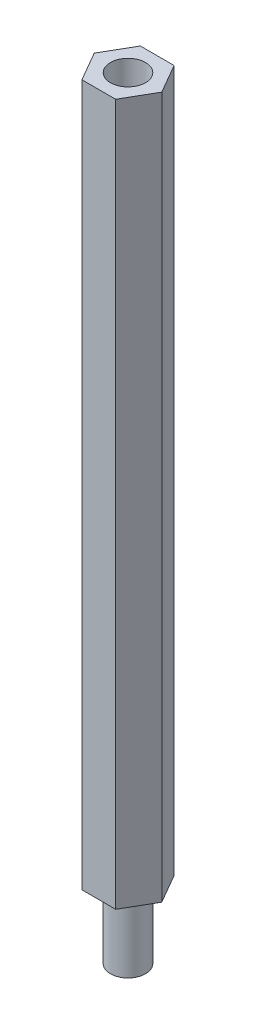
ISO-10303-21;
HEADER;
FILE_DESCRIPTION(('STEP AP214'),'2;1');
FILE_NAME('part.step','',(''),(''),'','','');
FILE_SCHEMA(('AUTOMOTIVE_DESIGN { 1 0 10303 214 1 1 1 1 }'));
ENDSEC;
DATA;
#1=APPLICATION_CONTEXT('core data for automotive mechanical design processes');
#2=APPLICATION_PROTOCOL_DEFINITION('international standard','automotive_design',2000,#1);
#3=PRODUCT_CONTEXT('',#1,'mechanical');
#4=PRODUCT('Part','Part','',(#3));
#5=PRODUCT_RELATED_PRODUCT_CATEGORY('part','',(#4));
#6=PRODUCT_DEFINITION_FORMATION('','',#4);
#7=PRODUCT_DEFINITION_CONTEXT('part definition',#1,'design');
#8=PRODUCT_DEFINITION('design','',#6,#7);
#9=PRODUCT_DEFINITION_SHAPE('','',#8);
#10=(LENGTH_UNIT() NAMED_UNIT(*) SI_UNIT(.MILLI.,.METRE.));
#11=(NAMED_UNIT(*) PLANE_ANGLE_UNIT() SI_UNIT($,.RADIAN.));
#12=(NAMED_UNIT(*) SI_UNIT($,.STERADIAN.) SOLID_ANGLE_UNIT());
#13=UNCERTAINTY_MEASURE_WITH_UNIT(LENGTH_MEASURE(1.E-05),#10,'distance_accuracy_value','');
#14=(GEOMETRIC_REPRESENTATION_CONTEXT(3) GLOBAL_UNCERTAINTY_ASSIGNED_CONTEXT((#13)) GLOBAL_UNIT_ASSIGNED_CONTEXT((#10,
#11,#12)) REPRESENTATION_CONTEXT('',''));
#15=CARTESIAN_POINT('',(0.,0.,0.));
#16=DIRECTION('',(0.,0.,1.));
#17=DIRECTION('',(1.,0.,0.));
#18=AXIS2_PLACEMENT_3D('',#15,#16,#17);
#19=CARTESIAN_POINT('',(-118.553263391177,736.792319552453,160.917570962768));
#20=DIRECTION('',(0.,1.,0.));
#21=DIRECTION('',(0.,0.,-1.));
#22=AXIS2_PLACEMENT_3D('',#19,#20,#21);
#23=CYLINDRICAL_SURFACE('',#22,1.);
#24=CARTESIAN_POINT('',(-118.553263391177,729.292319552453,160.917570962768));
#25=DIRECTION('',(0.,-1.,0.));
#26=DIRECTION('',(0.,0.,-1.));
#27=AXIS2_PLACEMENT_3D('',#24,#25,#26);
#28=CIRCLE('',#27,1.);
#29=CARTESIAN_POINT('',(-118.553263391177,729.292319552453,159.917570962768));
#30=VERTEX_POINT('',#29);
#31=EDGE_CURVE('E201',#30,#30,#28,.F.);
#32=ORIENTED_EDGE('',*,*,#31,.F.);
#33=EDGE_LOOP('',(#32));
#34=FACE_BOUND('',#33,.T.);
#35=CARTESIAN_POINT('',(-118.553263391177,769.292319552453,160.917570962768));
#36=DIRECTION('',(0.,1.,0.));
#37=DIRECTION('',(0.,0.,1.));
#38=AXIS2_PLACEMENT_3D('',#35,#36,#37);
#39=CIRCLE('',#38,1.);
#40=CARTESIAN_POINT('',(-118.553263391177,769.292319552453,161.917570962768));
#41=VERTEX_POINT('',#40);
#42=EDGE_CURVE('E118',#41,#41,#39,.F.);
#43=ORIENTED_EDGE('',*,*,#42,.F.);
#44=EDGE_LOOP('',(#43));
#45=FACE_BOUND('',#44,.T.);
#46=ADVANCED_FACE('F34',(#34,#45),#23,.F.);
#47=CARTESIAN_POINT('',(-117.109887718177,744.292319552453,163.417570962768));
#48=DIRECTION('',(-0.866025403838329,0.,-0.499999999906659));
#49=DIRECTION('',(-0.499999999906659,0.,0.866025403838329));
#50=AXIS2_PLACEMENT_3D('',#47,#48,#49);
#51=PLANE('',#50);
#52=DIRECTION('',(0.500000000006738,0.,-0.866025403780548));
#53=VECTOR('',#52,1.);
#54=CARTESIAN_POINT('',(-117.109887718177,729.292319552453,163.417570962768));
#55=LINE('',#54,#53);
#56=CARTESIAN_POINT('',(-117.109887718177,729.292319552453,163.417570962768));
#57=VERTEX_POINT('',#56);
#58=CARTESIAN_POINT('',(-115.666512045177,729.292319552453,160.917570962768));
#59=VERTEX_POINT('',#58);
#60=EDGE_CURVE('E43',#57,#59,#55,.T.);
#61=ORIENTED_EDGE('',*,*,#60,.T.);
#62=DIRECTION('',(0.,-1.,0.));
#63=VECTOR('',#62,1.);
#64=CARTESIAN_POINT('',(-115.666512045177,744.292319552453,160.917570962768));
#65=LINE('',#64,#63);
#66=CARTESIAN_POINT('',(-115.666512045177,789.292319552453,160.917570962768));
#67=VERTEX_POINT('',#66);
#68=EDGE_CURVE('E51',#67,#59,#65,.T.);
#69=ORIENTED_EDGE('',*,*,#68,.F.);
#70=DIRECTION('',(0.500000000006738,0.,-0.866025403780549));
#71=VECTOR('',#70,1.);
#72=CARTESIAN_POINT('',(-117.109887718177,789.292319552453,163.417570962768));
#73=LINE('',#72,#71);
#74=CARTESIAN_POINT('',(-117.109887718177,789.292319552453,163.417570962768));
#75=VERTEX_POINT('',#74);
#76=EDGE_CURVE('E108',#75,#67,#73,.T.);
#77=ORIENTED_EDGE('',*,*,#76,.F.);
#78=DIRECTION('',(0.,-1.,0.));
#79=VECTOR('',#78,1.);
#80=CARTESIAN_POINT('',(-117.109887718177,744.292319552453,163.417570962768));
#81=LINE('',#80,#79);
#82=EDGE_CURVE('E96',#75,#57,#81,.T.);
#83=ORIENTED_EDGE('',*,*,#82,.T.);
#84=EDGE_LOOP('',(#61,#69,#77,#83));
#85=FACE_BOUND('',#84,.T.);
#86=ADVANCED_FACE('F109',(#85),#51,.F.);
#87=CARTESIAN_POINT('',(-115.666512045177,744.292319552453,160.917570962768));
#88=DIRECTION('',(-0.866025403838329,0.,0.499999999906659));
#89=DIRECTION('',(0.499999999906659,0.,0.866025403838329));
#90=AXIS2_PLACEMENT_3D('',#87,#88,#89);
#91=PLANE('',#90);
#92=DIRECTION('',(-0.500000000006738,0.,-0.866025403780548));
#93=VECTOR('',#92,1.);
#94=CARTESIAN_POINT('',(-115.666512045177,729.292319552453,160.917570962768));
#95=LINE('',#94,#93);
#96=CARTESIAN_POINT('',(-117.109887718177,729.292319552453,158.417570962768));
#97=VERTEX_POINT('',#96);
#98=EDGE_CURVE('E105',#59,#97,#95,.T.);
#99=ORIENTED_EDGE('',*,*,#98,.T.);
#100=DIRECTION('',(0.,-1.,0.));
#101=VECTOR('',#100,1.);
#102=CARTESIAN_POINT('',(-117.109887718177,744.292319552453,158.417570962768));
#103=LINE('',#102,#101);
#104=CARTESIAN_POINT('',(-117.109887718177,789.292319552453,158.417570962768));
#105=VERTEX_POINT('',#104);
#106=EDGE_CURVE('E67',#105,#97,#103,.T.);
#107=ORIENTED_EDGE('',*,*,#106,.F.);
#108=DIRECTION('',(-0.500000000006738,0.,-0.866025403780549));
#109=VECTOR('',#108,1.);
#110=CARTESIAN_POINT('',(-115.666512045177,789.292319552453,160.917570962768));
#111=LINE('',#110,#109);
#112=EDGE_CURVE('E112',#67,#105,#111,.T.);
#113=ORIENTED_EDGE('',*,*,#112,.F.);
#114=ORIENTED_EDGE('',*,*,#68,.T.);
#115=EDGE_LOOP('',(#99,#107,#113,#114));
#116=FACE_BOUND('',#115,.T.);
#117=ADVANCED_FACE('F168',(#116),#91,.F.);
#118=CARTESIAN_POINT('',(-117.109887718177,744.292319552453,158.417570962768));
#119=DIRECTION('',(0.,0.,1.));
#120=DIRECTION('',(1.,0.,0.));
#121=AXIS2_PLACEMENT_3D('',#118,#119,#120);
#122=PLANE('',#121);
#123=DIRECTION('',(-1.,0.,0.));
#124=VECTOR('',#123,1.);
#125=CARTESIAN_POINT('',(-117.109887718177,729.292319552453,158.417570962768));
#126=LINE('',#125,#124);
#127=CARTESIAN_POINT('',(-119.996639064177,729.292319552453,158.417570962768));
#128=VERTEX_POINT('',#127);
#129=EDGE_CURVE('E135',#97,#128,#126,.T.);
#130=ORIENTED_EDGE('',*,*,#129,.T.);
#131=DIRECTION('',(0.,-1.,0.));
#132=VECTOR('',#131,1.);
#133=CARTESIAN_POINT('',(-119.996639064177,744.292319552453,158.417570962768));
#134=LINE('',#133,#132);
#135=CARTESIAN_POINT('',(-119.996639064177,789.292319552453,158.417570962768));
#136=VERTEX_POINT('',#135);
#137=EDGE_CURVE('E73',#136,#128,#134,.T.);
#138=ORIENTED_EDGE('',*,*,#137,.F.);
#139=DIRECTION('',(-1.,0.,0.));
#140=VECTOR('',#139,1.);
#141=CARTESIAN_POINT('',(-117.109887718177,789.292319552453,158.417570962768));
#142=LINE('',#141,#140);
#143=EDGE_CURVE('E127',#105,#136,#142,.T.);
#144=ORIENTED_EDGE('',*,*,#143,.F.);
#145=ORIENTED_EDGE('',*,*,#106,.T.);
#146=EDGE_LOOP('',(#130,#138,#144,#145));
#147=FACE_BOUND('',#146,.T.);
#148=ADVANCED_FACE('F159',(#147),#122,.F.);
#149=CARTESIAN_POINT('',(-119.996639064177,744.292319552453,158.417570962768));
#150=DIRECTION('',(0.866025403838329,0.,0.499999999906659));
#151=DIRECTION('',(0.499999999906659,0.,-0.866025403838329));
#152=AXIS2_PLACEMENT_3D('',#149,#150,#151);
#153=PLANE('',#152);
#154=DIRECTION('',(-0.500000000006738,0.,0.866025403780548));
#155=VECTOR('',#154,1.);
#156=CARTESIAN_POINT('',(-119.996639064177,729.292319552453,158.417570962768));
#157=LINE('',#156,#155);
#158=CARTESIAN_POINT('',(-121.440014737177,729.292319552453,160.917570962768));
#159=VERTEX_POINT('',#158);
#160=EDGE_CURVE('E142',#128,#159,#157,.T.);
#161=ORIENTED_EDGE('',*,*,#160,.T.);
#162=DIRECTION('',(0.,-1.,0.));
#163=VECTOR('',#162,1.);
#164=CARTESIAN_POINT('',(-121.440014737177,744.292319552453,160.917570962768));
#165=LINE('',#164,#163);
#166=CARTESIAN_POINT('',(-121.440014737177,789.292319552453,160.917570962768));
#167=VERTEX_POINT('',#166);
#168=EDGE_CURVE('E79',#167,#159,#165,.T.);
#169=ORIENTED_EDGE('',*,*,#168,.F.);
#170=DIRECTION('',(-0.500000000006738,0.,0.866025403780549));
#171=VECTOR('',#170,1.);
#172=CARTESIAN_POINT('',(-119.996639064177,789.292319552453,158.417570962768));
#173=LINE('',#172,#171);
#174=EDGE_CURVE('E130',#136,#167,#173,.T.);
#175=ORIENTED_EDGE('',*,*,#174,.F.);
#176=ORIENTED_EDGE('',*,*,#137,.T.);
#177=EDGE_LOOP('',(#161,#169,#175,#176));
#178=FACE_BOUND('',#177,.T.);
#179=ADVANCED_FACE('F149',(#178),#153,.F.);
#180=CARTESIAN_POINT('',(-121.440014737177,744.292319552453,160.917570962768));
#181=DIRECTION('',(0.866025403838329,0.,-0.499999999906659));
#182=DIRECTION('',(-0.499999999906659,0.,-0.866025403838329));
#183=AXIS2_PLACEMENT_3D('',#180,#181,#182);
#184=PLANE('',#183);
#185=DIRECTION('',(0.500000000006738,0.,0.866025403780548));
#186=VECTOR('',#185,1.);
#187=CARTESIAN_POINT('',(-121.440014737177,729.292319552453,160.917570962768));
#188=LINE('',#187,#186);
#189=CARTESIAN_POINT('',(-119.996639064177,729.292319552453,163.417570962768));
#190=VERTEX_POINT('',#189);
#191=EDGE_CURVE('E137',#159,#190,#188,.T.);
#192=ORIENTED_EDGE('',*,*,#191,.T.);
#193=DIRECTION('',(0.,-1.,0.));
#194=VECTOR('',#193,1.);
#195=CARTESIAN_POINT('',(-119.996639064177,744.292319552453,163.417570962768));
#196=LINE('',#195,#194);
#197=CARTESIAN_POINT('',(-119.996639064177,789.292319552453,163.417570962768));
#198=VERTEX_POINT('',#197);
#199=EDGE_CURVE('E133',#198,#190,#196,.T.);
#200=ORIENTED_EDGE('',*,*,#199,.F.);
#201=DIRECTION('',(0.500000000006738,0.,0.866025403780549));
#202=VECTOR('',#201,1.);
#203=CARTESIAN_POINT('',(-121.440014737177,789.292319552453,160.917570962768));
#204=LINE('',#203,#202);
#205=EDGE_CURVE('E117',#167,#198,#204,.T.);
#206=ORIENTED_EDGE('',*,*,#205,.F.);
#207=ORIENTED_EDGE('',*,*,#168,.T.);
#208=EDGE_LOOP('',(#192,#200,#206,#207));
#209=FACE_BOUND('',#208,.T.);
#210=ADVANCED_FACE('F152',(#209),#184,.F.);
#211=CARTESIAN_POINT('',(-119.996639064177,744.292319552453,163.417570962768));
#212=DIRECTION('',(0.,0.,-1.));
#213=DIRECTION('',(-1.,0.,0.));
#214=AXIS2_PLACEMENT_3D('',#211,#212,#213);
#215=PLANE('',#214);
#216=DIRECTION('',(1.,0.,0.));
#217=VECTOR('',#216,1.);
#218=CARTESIAN_POINT('',(-119.996639064177,729.292319552453,163.417570962768));
#219=LINE('',#218,#217);
#220=EDGE_CURVE('E102',#190,#57,#219,.T.);
#221=ORIENTED_EDGE('',*,*,#220,.T.);
#222=ORIENTED_EDGE('',*,*,#82,.F.);
#223=DIRECTION('',(1.,0.,0.));
#224=VECTOR('',#223,1.);
#225=CARTESIAN_POINT('',(-119.996639064177,789.292319552453,163.417570962768));
#226=LINE('',#225,#224);
#227=EDGE_CURVE('E100',#198,#75,#226,.T.);
#228=ORIENTED_EDGE('',*,*,#227,.F.);
#229=ORIENTED_EDGE('',*,*,#199,.T.);
#230=EDGE_LOOP('',(#221,#222,#228,#229));
#231=FACE_BOUND('',#230,.T.);
#232=ADVANCED_FACE('F98',(#231),#215,.F.);
#233=CARTESIAN_POINT('',(-118.553263391177,729.292319552453,160.917570962768));
#234=DIRECTION('',(0.,1.,0.));
#235=DIRECTION('',(0.,0.,1.));
#236=AXIS2_PLACEMENT_3D('',#233,#234,#235);
#237=PLANE('',#236);
#238=CARTESIAN_POINT('',(-118.553263391177,729.292319552453,160.917570962768));
#239=DIRECTION('',(0.,1.,0.));
#240=DIRECTION('',(0.,0.,1.));
#241=AXIS2_PLACEMENT_3D('',#238,#239,#240);
#242=CIRCLE('',#241,1.5);
#243=CARTESIAN_POINT('',(-118.553263391177,729.292319552453,162.417570962768));
#244=VERTEX_POINT('',#243);
#245=EDGE_CURVE('E11',#244,#244,#242,.F.);
#246=ORIENTED_EDGE('',*,*,#245,.F.);
#247=EDGE_LOOP('',(#246));
#248=FACE_BOUND('',#247,.T.);
#249=ORIENTED_EDGE('',*,*,#60,.F.);
#250=ORIENTED_EDGE('',*,*,#220,.F.);
#251=ORIENTED_EDGE('',*,*,#191,.F.);
#252=ORIENTED_EDGE('',*,*,#160,.F.);
#253=ORIENTED_EDGE('',*,*,#129,.F.);
#254=ORIENTED_EDGE('',*,*,#98,.F.);
#255=EDGE_LOOP('',(#249,#250,#251,#252,#253,#254));
#256=FACE_BOUND('',#255,.T.);
#257=ADVANCED_FACE('F36',(#248,#256),#237,.F.);
#258=CARTESIAN_POINT('',(0.,789.292319552453,0.));
#259=DIRECTION('',(0.,1.,0.));
#260=DIRECTION('',(0.,0.,1.));
#261=AXIS2_PLACEMENT_3D('',#258,#259,#260);
#262=PLANE('',#261);
#263=CARTESIAN_POINT('',(-118.553263391177,789.292319552453,160.917570962768));
#264=DIRECTION('',(0.,1.,0.));
#265=DIRECTION('',(0.,0.,1.));
#266=AXIS2_PLACEMENT_3D('',#263,#264,#265);
#267=CIRCLE('',#266,1.5);
#268=CARTESIAN_POINT('',(-118.553263391177,789.292319552453,162.417570962768));
#269=VERTEX_POINT('',#268);
#270=EDGE_CURVE('E123',#269,#269,#267,.T.);
#271=ORIENTED_EDGE('',*,*,#270,.F.);
#272=EDGE_LOOP('',(#271));
#273=FACE_BOUND('',#272,.T.);
#274=ORIENTED_EDGE('',*,*,#227,.T.);
#275=ORIENTED_EDGE('',*,*,#76,.T.);
#276=ORIENTED_EDGE('',*,*,#112,.T.);
#277=ORIENTED_EDGE('',*,*,#143,.T.);
#278=ORIENTED_EDGE('',*,*,#174,.T.);
#279=ORIENTED_EDGE('',*,*,#205,.T.);
#280=EDGE_LOOP('',(#274,#275,#276,#277,#278,#279));
#281=FACE_BOUND('',#280,.T.);
#282=ADVANCED_FACE('F115',(#273,#281),#262,.T.);
#283=CARTESIAN_POINT('',(-118.553263391177,769.292319552453,160.917570962768));
#284=DIRECTION('',(0.,1.,0.));
#285=DIRECTION('',(0.,0.,1.));
#286=AXIS2_PLACEMENT_3D('',#283,#284,#285);
#287=PLANE('',#286);
#288=CARTESIAN_POINT('',(-118.553263391177,769.292319552453,160.917570962768));
#289=DIRECTION('',(0.,1.,0.));
#290=DIRECTION('',(0.,0.,1.));
#291=AXIS2_PLACEMENT_3D('',#288,#289,#290);
#292=CIRCLE('',#291,1.5);
#293=CARTESIAN_POINT('',(-118.553263391177,769.292319552453,162.417570962768));
#294=VERTEX_POINT('',#293);
#295=EDGE_CURVE('E121',#294,#294,#292,.T.);
#296=ORIENTED_EDGE('',*,*,#295,.T.);
#297=EDGE_LOOP('',(#296));
#298=FACE_BOUND('',#297,.T.);
#299=ORIENTED_EDGE('',*,*,#42,.T.);
#300=EDGE_LOOP('',(#299));
#301=FACE_BOUND('',#300,.T.);
#302=ADVANCED_FACE('F176',(#298,#301),#287,.T.);
#303=CARTESIAN_POINT('',(-118.553263391177,769.292319552453,160.917570962768));
#304=DIRECTION('',(0.,1.,0.));
#305=DIRECTION('',(0.,0.,1.));
#306=AXIS2_PLACEMENT_3D('',#303,#304,#305);
#307=CYLINDRICAL_SURFACE('',#306,1.5);
#308=ORIENTED_EDGE('',*,*,#295,.F.);
#309=EDGE_LOOP('',(#308));
#310=FACE_BOUND('',#309,.T.);
#311=ORIENTED_EDGE('',*,*,#270,.T.);
#312=EDGE_LOOP('',(#311));
#313=FACE_BOUND('',#312,.T.);
#314=ADVANCED_FACE('F178',(#310,#313),#307,.F.);
#315=CARTESIAN_POINT('',(-118.553263391177,723.292319552453,160.917570962768));
#316=DIRECTION('',(0.,-1.,0.));
#317=DIRECTION('',(0.,0.,-1.));
#318=AXIS2_PLACEMENT_3D('',#315,#316,#317);
#319=PLANE('',#318);
#320=CARTESIAN_POINT('',(-118.553263391177,723.292319552453,160.917570962768));
#321=DIRECTION('',(0.,-1.,0.));
#322=DIRECTION('',(0.,0.,-1.));
#323=AXIS2_PLACEMENT_3D('',#320,#321,#322);
#324=CIRCLE('',#323,1.5);
#325=CARTESIAN_POINT('',(-118.553263391177,723.292319552453,159.417570962768));
#326=VERTEX_POINT('',#325);
#327=EDGE_CURVE('E200',#326,#326,#324,.T.);
#328=ORIENTED_EDGE('',*,*,#327,.T.);
#329=EDGE_LOOP('',(#328));
#330=FACE_BOUND('',#329,.T.);
#331=ADVANCED_FACE('F181',(#330),#319,.T.);
#332=CARTESIAN_POINT('',(-118.553263391177,723.292319552453,160.917570962768));
#333=DIRECTION('',(0.,1.,0.));
#334=DIRECTION('',(0.,0.,1.));
#335=AXIS2_PLACEMENT_3D('',#332,#333,#334);
#336=CYLINDRICAL_SURFACE('',#335,1.5);
#337=ORIENTED_EDGE('',*,*,#327,.F.);
#338=EDGE_LOOP('',(#337));
#339=FACE_BOUND('',#338,.T.);
#340=ORIENTED_EDGE('',*,*,#245,.T.);
#341=EDGE_LOOP('',(#340));
#342=FACE_BOUND('',#341,.T.);
#343=ADVANCED_FACE('F186',(#339,#342),#336,.T.);
#344=CARTESIAN_POINT('',(-118.553263391177,729.292319552453,160.917570962768));
#345=DIRECTION('',(0.,-1.,0.));
#346=DIRECTION('',(0.,0.,-1.));
#347=AXIS2_PLACEMENT_3D('',#344,#345,#346);
#348=PLANE('',#347);
#349=ORIENTED_EDGE('',*,*,#31,.T.);
#350=EDGE_LOOP('',(#349));
#351=FACE_BOUND('',#350,.T.);
#352=ADVANCED_FACE('F189',(#351),#348,.F.);
#353=CLOSED_SHELL('',(#46,#86,#117,#148,#179,#210,#232,#257,#282,#302,#314,#331,#343,#352));
#354=MANIFOLD_SOLID_BREP('B2',#353);
#355=ADVANCED_BREP_SHAPE_REPRESENTATION('',(#18,#354),#14);
#356=SHAPE_DEFINITION_REPRESENTATION(#9,#355);
ENDSEC;
END-ISO-10303-21;
